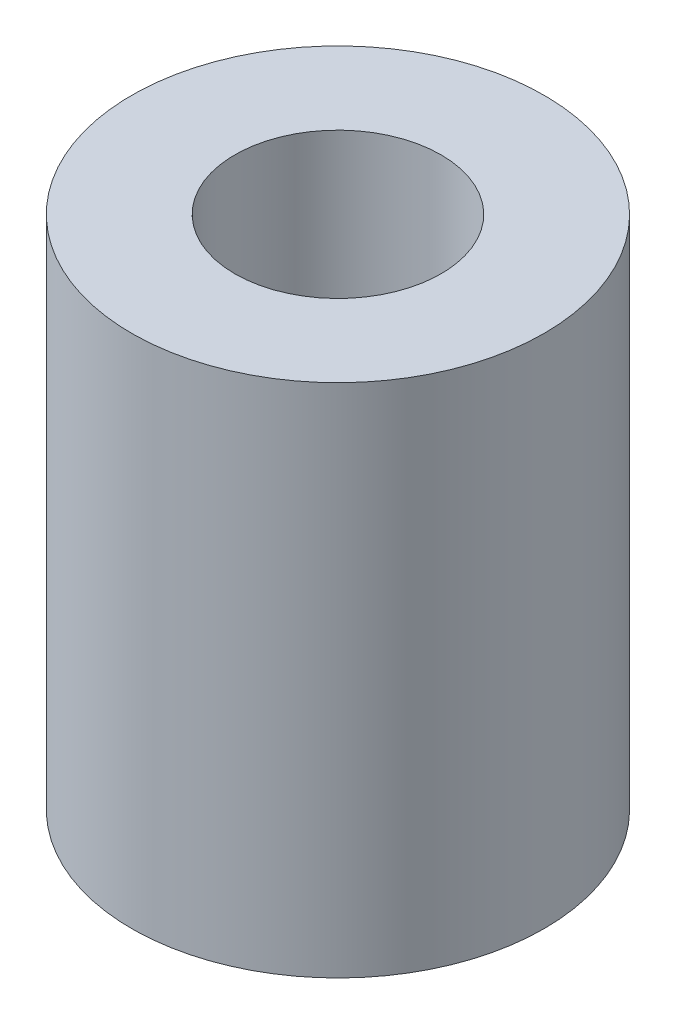
ISO-10303-21;
HEADER;
FILE_DESCRIPTION(('STEP AP214'),'2;1');
FILE_NAME('part.step','',(''),(''),'','','');
FILE_SCHEMA(('AUTOMOTIVE_DESIGN { 1 0 10303 214 1 1 1 1 }'));
ENDSEC;
DATA;
#1=APPLICATION_CONTEXT('core data for automotive mechanical design processes');
#2=APPLICATION_PROTOCOL_DEFINITION('international standard','automotive_design',2000,#1);
#3=PRODUCT_CONTEXT('',#1,'mechanical');
#4=PRODUCT('Part','Part','',(#3));
#5=PRODUCT_RELATED_PRODUCT_CATEGORY('part','',(#4));
#6=PRODUCT_DEFINITION_FORMATION('','',#4);
#7=PRODUCT_DEFINITION_CONTEXT('part definition',#1,'design');
#8=PRODUCT_DEFINITION('design','',#6,#7);
#9=PRODUCT_DEFINITION_SHAPE('','',#8);
#10=(LENGTH_UNIT() NAMED_UNIT(*) SI_UNIT(.MILLI.,.METRE.));
#11=(NAMED_UNIT(*) PLANE_ANGLE_UNIT() SI_UNIT($,.RADIAN.));
#12=(NAMED_UNIT(*) SI_UNIT($,.STERADIAN.) SOLID_ANGLE_UNIT());
#13=UNCERTAINTY_MEASURE_WITH_UNIT(LENGTH_MEASURE(1.E-05),#10,'distance_accuracy_value','');
#14=(GEOMETRIC_REPRESENTATION_CONTEXT(3) GLOBAL_UNCERTAINTY_ASSIGNED_CONTEXT((#13)) GLOBAL_UNIT_ASSIGNED_CONTEXT((#10,
#11,#12)) REPRESENTATION_CONTEXT('',''));
#15=CARTESIAN_POINT('',(0.,0.,0.));
#16=DIRECTION('',(0.,0.,1.));
#17=DIRECTION('',(1.,0.,0.));
#18=AXIS2_PLACEMENT_3D('',#15,#16,#17);
#19=CARTESIAN_POINT('',(0.,10.,0.));
#20=DIRECTION('',(0.,1.,0.));
#21=DIRECTION('',(0.,0.,1.));
#22=AXIS2_PLACEMENT_3D('',#19,#20,#21);
#23=PLANE('',#22);
#24=CARTESIAN_POINT('',(0.,10.,0.));
#25=DIRECTION('',(0.,1.,0.));
#26=DIRECTION('',(1.,0.,0.));
#27=AXIS2_PLACEMENT_3D('',#24,#25,#26);
#28=CIRCLE('',#27,4.);
#29=CARTESIAN_POINT('',(4.,10.,0.));
#30=VERTEX_POINT('',#29);
#31=EDGE_CURVE('E11',#30,#30,#28,.T.);
#32=ORIENTED_EDGE('',*,*,#31,.T.);
#33=EDGE_LOOP('',(#32));
#34=FACE_BOUND('',#33,.T.);
#35=CARTESIAN_POINT('',(0.,10.,0.));
#36=DIRECTION('',(0.,1.,0.));
#37=DIRECTION('',(0.,0.,1.));
#38=AXIS2_PLACEMENT_3D('',#35,#36,#37);
#39=CIRCLE('',#38,2.);
#40=CARTESIAN_POINT('',(0.,10.,2.));
#41=VERTEX_POINT('',#40);
#42=EDGE_CURVE('E62',#41,#41,#39,.T.);
#43=ORIENTED_EDGE('',*,*,#42,.F.);
#44=EDGE_LOOP('',(#43));
#45=FACE_BOUND('',#44,.T.);
#46=ADVANCED_FACE('F49',(#34,#45),#23,.T.);
#47=CARTESIAN_POINT('',(0.,0.,0.));
#48=DIRECTION('',(0.,1.,0.));
#49=DIRECTION('',(0.,0.,1.));
#50=AXIS2_PLACEMENT_3D('',#47,#48,#49);
#51=PLANE('',#50);
#52=CARTESIAN_POINT('',(0.,0.,0.));
#53=DIRECTION('',(0.,1.,0.));
#54=DIRECTION('',(1.,0.,0.));
#55=AXIS2_PLACEMENT_3D('',#52,#53,#54);
#56=CIRCLE('',#55,4.);
#57=CARTESIAN_POINT('',(4.,0.,0.));
#58=VERTEX_POINT('',#57);
#59=EDGE_CURVE('E53',#58,#58,#56,.T.);
#60=ORIENTED_EDGE('',*,*,#59,.F.);
#61=EDGE_LOOP('',(#60));
#62=FACE_BOUND('',#61,.T.);
#63=CARTESIAN_POINT('',(0.,0.,0.));
#64=DIRECTION('',(0.,1.,0.));
#65=DIRECTION('',(0.,0.,1.));
#66=AXIS2_PLACEMENT_3D('',#63,#64,#65);
#67=CIRCLE('',#66,2.);
#68=CARTESIAN_POINT('',(0.,0.,2.));
#69=VERTEX_POINT('',#68);
#70=EDGE_CURVE('E64',#69,#69,#67,.T.);
#71=ORIENTED_EDGE('',*,*,#70,.T.);
#72=EDGE_LOOP('',(#71));
#73=FACE_BOUND('',#72,.T.);
#74=ADVANCED_FACE('F76',(#62,#73),#51,.F.);
#75=CARTESIAN_POINT('',(0.,10.,0.));
#76=DIRECTION('',(0.,-1.,0.));
#77=DIRECTION('',(0.,0.,-1.));
#78=AXIS2_PLACEMENT_3D('',#75,#76,#77);
#79=CYLINDRICAL_SURFACE('',#78,4.);
#80=ORIENTED_EDGE('',*,*,#31,.F.);
#81=EDGE_LOOP('',(#80));
#82=FACE_BOUND('',#81,.T.);
#83=ORIENTED_EDGE('',*,*,#59,.T.);
#84=EDGE_LOOP('',(#83));
#85=FACE_BOUND('',#84,.T.);
#86=ADVANCED_FACE('F51',(#82,#85),#79,.T.);
#87=CARTESIAN_POINT('',(0.,10.,0.));
#88=DIRECTION('',(0.,-1.,0.));
#89=DIRECTION('',(0.,0.,-1.));
#90=AXIS2_PLACEMENT_3D('',#87,#88,#89);
#91=CYLINDRICAL_SURFACE('',#90,2.);
#92=ORIENTED_EDGE('',*,*,#42,.T.);
#93=EDGE_LOOP('',(#92));
#94=FACE_BOUND('',#93,.T.);
#95=ORIENTED_EDGE('',*,*,#70,.F.);
#96=EDGE_LOOP('',(#95));
#97=FACE_BOUND('',#96,.T.);
#98=ADVANCED_FACE('F72',(#94,#97),#91,.F.);
#99=CLOSED_SHELL('',(#46,#74,#86,#98));
#100=MANIFOLD_SOLID_BREP('B2',#99);
#101=ADVANCED_BREP_SHAPE_REPRESENTATION('',(#18,#100),#14);
#102=SHAPE_DEFINITION_REPRESENTATION(#9,#101);
ENDSEC;
END-ISO-10303-21;
